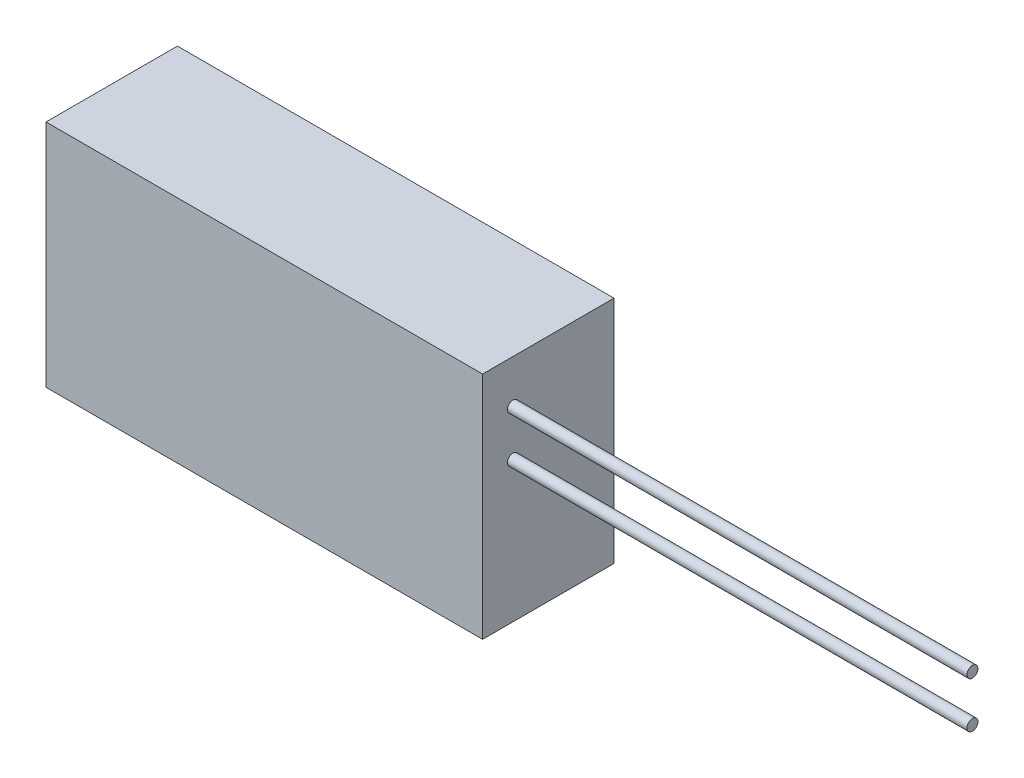
ISO-10303-21;
HEADER;
FILE_DESCRIPTION(('STEP AP214'),'2;1');
FILE_NAME('part.step','',(''),(''),'','','');
FILE_SCHEMA(('AUTOMOTIVE_DESIGN { 1 0 10303 214 1 1 1 1 }'));
ENDSEC;
DATA;
#1=APPLICATION_CONTEXT('core data for automotive mechanical design processes');
#2=APPLICATION_PROTOCOL_DEFINITION('international standard','automotive_design',2000,#1);
#3=PRODUCT_CONTEXT('',#1,'mechanical');
#4=PRODUCT('Part','Part','',(#3));
#5=PRODUCT_RELATED_PRODUCT_CATEGORY('part','',(#4));
#6=PRODUCT_DEFINITION_FORMATION('','',#4);
#7=PRODUCT_DEFINITION_CONTEXT('part definition',#1,'design');
#8=PRODUCT_DEFINITION('design','',#6,#7);
#9=PRODUCT_DEFINITION_SHAPE('','',#8);
#10=(LENGTH_UNIT() NAMED_UNIT(*) SI_UNIT(.MILLI.,.METRE.));
#11=(NAMED_UNIT(*) PLANE_ANGLE_UNIT() SI_UNIT($,.RADIAN.));
#12=(NAMED_UNIT(*) SI_UNIT($,.STERADIAN.) SOLID_ANGLE_UNIT());
#13=UNCERTAINTY_MEASURE_WITH_UNIT(LENGTH_MEASURE(1.E-05),#10,'distance_accuracy_value','');
#14=(GEOMETRIC_REPRESENTATION_CONTEXT(3) GLOBAL_UNCERTAINTY_ASSIGNED_CONTEXT((#13)) GLOBAL_UNIT_ASSIGNED_CONTEXT((#10,
#11,#12)) REPRESENTATION_CONTEXT('',''));
#15=CARTESIAN_POINT('',(0.,0.,0.));
#16=DIRECTION('',(0.,0.,1.));
#17=DIRECTION('',(1.,0.,0.));
#18=AXIS2_PLACEMENT_3D('',#15,#16,#17);
#19=CARTESIAN_POINT('',(-23.75,-12.5,7.15));
#20=DIRECTION('',(1.,0.,0.));
#21=DIRECTION('',(0.,0.,-1.));
#22=AXIS2_PLACEMENT_3D('',#19,#20,#21);
#23=PLANE('',#22);
#24=DIRECTION('',(0.,-1.,0.));
#25=VECTOR('',#24,1.);
#26=CARTESIAN_POINT('',(-23.75,-12.5,-7.15));
#27=LINE('',#26,#25);
#28=CARTESIAN_POINT('',(-23.75,12.5,-7.15));
#29=VERTEX_POINT('',#28);
#30=CARTESIAN_POINT('',(-23.75,-12.5,-7.15));
#31=VERTEX_POINT('',#30);
#32=EDGE_CURVE('E100',#29,#31,#27,.T.);
#33=ORIENTED_EDGE('',*,*,#32,.T.);
#34=DIRECTION('',(0.,0.,-1.));
#35=VECTOR('',#34,1.);
#36=CARTESIAN_POINT('',(-23.75,-12.5,7.15));
#37=LINE('',#36,#35);
#38=CARTESIAN_POINT('',(-23.75,-12.5,7.15));
#39=VERTEX_POINT('',#38);
#40=EDGE_CURVE('E91',#39,#31,#37,.T.);
#41=ORIENTED_EDGE('',*,*,#40,.F.);
#42=DIRECTION('',(0.,-1.,0.));
#43=VECTOR('',#42,1.);
#44=CARTESIAN_POINT('',(-23.75,-12.5,7.15));
#45=LINE('',#44,#43);
#46=CARTESIAN_POINT('',(-23.75,12.5,7.15));
#47=VERTEX_POINT('',#46);
#48=EDGE_CURVE('E85',#47,#39,#45,.T.);
#49=ORIENTED_EDGE('',*,*,#48,.F.);
#50=DIRECTION('',(0.,0.,-1.));
#51=VECTOR('',#50,1.);
#52=CARTESIAN_POINT('',(-23.75,12.5,7.15));
#53=LINE('',#52,#51);
#54=EDGE_CURVE('E96',#47,#29,#53,.T.);
#55=ORIENTED_EDGE('',*,*,#54,.T.);
#56=EDGE_LOOP('',(#33,#41,#49,#55));
#57=FACE_BOUND('',#56,.T.);
#58=ADVANCED_FACE('F33',(#57),#23,.F.);
#59=CARTESIAN_POINT('',(23.75,-12.5,7.15));
#60=DIRECTION('',(0.,1.,0.));
#61=DIRECTION('',(-1.,0.,0.));
#62=AXIS2_PLACEMENT_3D('',#59,#60,#61);
#63=PLANE('',#62);
#64=DIRECTION('',(1.,0.,0.));
#65=VECTOR('',#64,1.);
#66=CARTESIAN_POINT('',(23.75,-12.5,-7.15));
#67=LINE('',#66,#65);
#68=CARTESIAN_POINT('',(23.75,-12.5,-7.15));
#69=VERTEX_POINT('',#68);
#70=EDGE_CURVE('E90',#31,#69,#67,.T.);
#71=ORIENTED_EDGE('',*,*,#70,.T.);
#72=DIRECTION('',(0.,0.,-1.));
#73=VECTOR('',#72,1.);
#74=CARTESIAN_POINT('',(23.75,-12.5,7.15));
#75=LINE('',#74,#73);
#76=CARTESIAN_POINT('',(23.75,-12.5,7.15));
#77=VERTEX_POINT('',#76);
#78=EDGE_CURVE('E88',#77,#69,#75,.T.);
#79=ORIENTED_EDGE('',*,*,#78,.F.);
#80=DIRECTION('',(1.,0.,0.));
#81=VECTOR('',#80,1.);
#82=CARTESIAN_POINT('',(23.75,-12.5,7.15));
#83=LINE('',#82,#81);
#84=EDGE_CURVE('E80',#39,#77,#83,.T.);
#85=ORIENTED_EDGE('',*,*,#84,.F.);
#86=ORIENTED_EDGE('',*,*,#40,.T.);
#87=EDGE_LOOP('',(#71,#79,#85,#86));
#88=FACE_BOUND('',#87,.T.);
#89=ADVANCED_FACE('F89',(#88),#63,.F.);
#90=CARTESIAN_POINT('',(23.75,-12.5,7.15));
#91=DIRECTION('',(-1.,0.,0.));
#92=DIRECTION('',(0.,0.,1.));
#93=AXIS2_PLACEMENT_3D('',#90,#91,#92);
#94=PLANE('',#93);
#95=CARTESIAN_POINT('',(23.75,7.8,3.85));
#96=DIRECTION('',(-1.,0.,0.));
#97=DIRECTION('',(0.,0.,1.));
#98=AXIS2_PLACEMENT_3D('',#95,#96,#97);
#99=CIRCLE('',#98,0.6);
#100=CARTESIAN_POINT('',(23.75,7.8,4.45));
#101=VERTEX_POINT('',#100);
#102=EDGE_CURVE('E11',#101,#101,#99,.F.);
#103=ORIENTED_EDGE('',*,*,#102,.F.);
#104=EDGE_LOOP('',(#103));
#105=FACE_BOUND('',#104,.T.);
#106=CARTESIAN_POINT('',(23.75,2.8,3.85));
#107=DIRECTION('',(-1.,0.,0.));
#108=DIRECTION('',(0.,0.,1.));
#109=AXIS2_PLACEMENT_3D('',#106,#107,#108);
#110=CIRCLE('',#109,0.6);
#111=CARTESIAN_POINT('',(23.75,2.8,4.45));
#112=VERTEX_POINT('',#111);
#113=EDGE_CURVE('E41',#112,#112,#110,.F.);
#114=ORIENTED_EDGE('',*,*,#113,.F.);
#115=EDGE_LOOP('',(#114));
#116=FACE_BOUND('',#115,.T.);
#117=DIRECTION('',(0.,1.,0.));
#118=VECTOR('',#117,1.);
#119=CARTESIAN_POINT('',(23.75,-12.5,-7.15));
#120=LINE('',#119,#118);
#121=CARTESIAN_POINT('',(23.75,12.5,-7.15));
#122=VERTEX_POINT('',#121);
#123=EDGE_CURVE('E66',#69,#122,#120,.T.);
#124=ORIENTED_EDGE('',*,*,#123,.T.);
#125=DIRECTION('',(0.,0.,-1.));
#126=VECTOR('',#125,1.);
#127=CARTESIAN_POINT('',(23.75,12.5,7.15));
#128=LINE('',#127,#126);
#129=CARTESIAN_POINT('',(23.75,12.5,7.15));
#130=VERTEX_POINT('',#129);
#131=EDGE_CURVE('E92',#130,#122,#128,.T.);
#132=ORIENTED_EDGE('',*,*,#131,.F.);
#133=DIRECTION('',(0.,1.,0.));
#134=VECTOR('',#133,1.);
#135=CARTESIAN_POINT('',(23.75,-12.5,7.15));
#136=LINE('',#135,#134);
#137=EDGE_CURVE('E83',#77,#130,#136,.T.);
#138=ORIENTED_EDGE('',*,*,#137,.F.);
#139=ORIENTED_EDGE('',*,*,#78,.T.);
#140=EDGE_LOOP('',(#124,#132,#138,#139));
#141=FACE_BOUND('',#140,.T.);
#142=ADVANCED_FACE('F94',(#105,#116,#141),#94,.F.);
#143=CARTESIAN_POINT('',(23.75,12.5,7.15));
#144=DIRECTION('',(0.,-1.,0.));
#145=DIRECTION('',(1.,0.,0.));
#146=AXIS2_PLACEMENT_3D('',#143,#144,#145);
#147=PLANE('',#146);
#148=DIRECTION('',(-1.,0.,0.));
#149=VECTOR('',#148,1.);
#150=CARTESIAN_POINT('',(23.75,12.5,-7.15));
#151=LINE('',#150,#149);
#152=EDGE_CURVE('E72',#122,#29,#151,.T.);
#153=ORIENTED_EDGE('',*,*,#152,.T.);
#154=ORIENTED_EDGE('',*,*,#54,.F.);
#155=DIRECTION('',(-1.,0.,0.));
#156=VECTOR('',#155,1.);
#157=CARTESIAN_POINT('',(23.75,12.5,7.15));
#158=LINE('',#157,#156);
#159=EDGE_CURVE('E49',#130,#47,#158,.T.);
#160=ORIENTED_EDGE('',*,*,#159,.F.);
#161=ORIENTED_EDGE('',*,*,#131,.T.);
#162=EDGE_LOOP('',(#153,#154,#160,#161));
#163=FACE_BOUND('',#162,.T.);
#164=ADVANCED_FACE('F115',(#163),#147,.F.);
#165=CARTESIAN_POINT('',(0.,0.,7.15));
#166=DIRECTION('',(0.,0.,1.));
#167=DIRECTION('',(1.,0.,0.));
#168=AXIS2_PLACEMENT_3D('',#165,#166,#167);
#169=PLANE('',#168);
#170=ORIENTED_EDGE('',*,*,#48,.T.);
#171=ORIENTED_EDGE('',*,*,#84,.T.);
#172=ORIENTED_EDGE('',*,*,#137,.T.);
#173=ORIENTED_EDGE('',*,*,#159,.T.);
#174=EDGE_LOOP('',(#170,#171,#172,#173));
#175=FACE_BOUND('',#174,.T.);
#176=ADVANCED_FACE('F81',(#175),#169,.T.);
#177=CARTESIAN_POINT('',(0.,0.,-7.15));
#178=DIRECTION('',(0.,0.,1.));
#179=DIRECTION('',(1.,0.,0.));
#180=AXIS2_PLACEMENT_3D('',#177,#178,#179);
#181=PLANE('',#180);
#182=ORIENTED_EDGE('',*,*,#32,.F.);
#183=ORIENTED_EDGE('',*,*,#152,.F.);
#184=ORIENTED_EDGE('',*,*,#123,.F.);
#185=ORIENTED_EDGE('',*,*,#70,.F.);
#186=EDGE_LOOP('',(#182,#183,#184,#185));
#187=FACE_BOUND('',#186,.T.);
#188=ADVANCED_FACE('F130',(#187),#181,.F.);
#189=CARTESIAN_POINT('',(73.75,2.8,3.85));
#190=DIRECTION('',(-1.,0.,0.));
#191=DIRECTION('',(0.,0.,1.));
#192=AXIS2_PLACEMENT_3D('',#189,#190,#191);
#193=CYLINDRICAL_SURFACE('',#192,0.6);
#194=CARTESIAN_POINT('',(73.75,2.8,3.85));
#195=DIRECTION('',(1.,0.,0.));
#196=DIRECTION('',(0.,0.,-1.));
#197=AXIS2_PLACEMENT_3D('',#194,#195,#196);
#198=CIRCLE('',#197,0.6);
#199=CARTESIAN_POINT('',(73.75,2.8,3.25));
#200=VERTEX_POINT('',#199);
#201=EDGE_CURVE('E103',#200,#200,#198,.T.);
#202=ORIENTED_EDGE('',*,*,#201,.F.);
#203=EDGE_LOOP('',(#202));
#204=FACE_BOUND('',#203,.T.);
#205=ORIENTED_EDGE('',*,*,#113,.T.);
#206=EDGE_LOOP('',(#205));
#207=FACE_BOUND('',#206,.T.);
#208=ADVANCED_FACE('F112',(#204,#207),#193,.T.);
#209=CARTESIAN_POINT('',(73.75,2.8,3.85));
#210=DIRECTION('',(1.,0.,0.));
#211=DIRECTION('',(0.,0.,-1.));
#212=AXIS2_PLACEMENT_3D('',#209,#210,#211);
#213=PLANE('',#212);
#214=ORIENTED_EDGE('',*,*,#201,.T.);
#215=EDGE_LOOP('',(#214));
#216=FACE_BOUND('',#215,.T.);
#217=ADVANCED_FACE('F137',(#216),#213,.T.);
#218=CARTESIAN_POINT('',(73.75,7.8,3.85));
#219=DIRECTION('',(-1.,0.,0.));
#220=DIRECTION('',(0.,0.,1.));
#221=AXIS2_PLACEMENT_3D('',#218,#219,#220);
#222=CYLINDRICAL_SURFACE('',#221,0.6);
#223=CARTESIAN_POINT('',(73.75,7.8,3.85));
#224=DIRECTION('',(1.,0.,0.));
#225=DIRECTION('',(0.,0.,-1.));
#226=AXIS2_PLACEMENT_3D('',#223,#224,#225);
#227=CIRCLE('',#226,0.6);
#228=CARTESIAN_POINT('',(73.75,7.8,3.25));
#229=VERTEX_POINT('',#228);
#230=EDGE_CURVE('E156',#229,#229,#227,.T.);
#231=ORIENTED_EDGE('',*,*,#230,.F.);
#232=EDGE_LOOP('',(#231));
#233=FACE_BOUND('',#232,.T.);
#234=ORIENTED_EDGE('',*,*,#102,.T.);
#235=EDGE_LOOP('',(#234));
#236=FACE_BOUND('',#235,.T.);
#237=ADVANCED_FACE('F144',(#233,#236),#222,.T.);
#238=CARTESIAN_POINT('',(73.75,7.8,3.85));
#239=DIRECTION('',(1.,0.,0.));
#240=DIRECTION('',(0.,0.,-1.));
#241=AXIS2_PLACEMENT_3D('',#238,#239,#240);
#242=PLANE('',#241);
#243=ORIENTED_EDGE('',*,*,#230,.T.);
#244=EDGE_LOOP('',(#243));
#245=FACE_BOUND('',#244,.T.);
#246=ADVANCED_FACE('F148',(#245),#242,.T.);
#247=CLOSED_SHELL('',(#58,#89,#142,#164,#176,#188,#208,#217,#237,#246));
#248=MANIFOLD_SOLID_BREP('B2',#247);
#249=ADVANCED_BREP_SHAPE_REPRESENTATION('',(#18,#248),#14);
#250=SHAPE_DEFINITION_REPRESENTATION(#9,#249);
ENDSEC;
END-ISO-10303-21;
